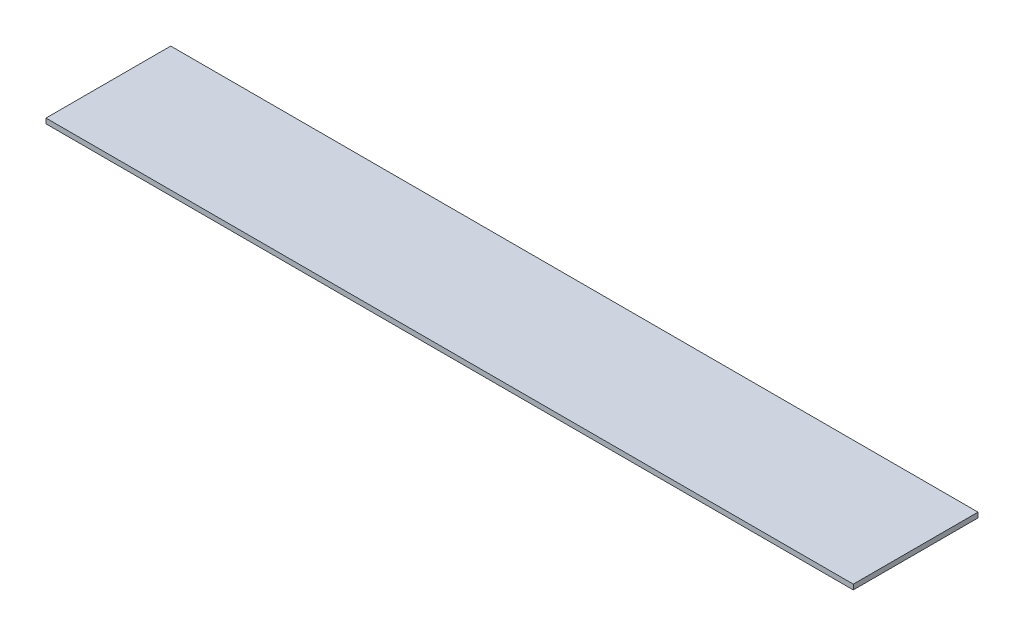
ISO-10303-21;
HEADER;
FILE_DESCRIPTION(('STEP AP214'),'2;1');
FILE_NAME('part.step','',(''),(''),'','','');
FILE_SCHEMA(('AUTOMOTIVE_DESIGN { 1 0 10303 214 1 1 1 1 }'));
ENDSEC;
DATA;
#1=APPLICATION_CONTEXT('core data for automotive mechanical design processes');
#2=APPLICATION_PROTOCOL_DEFINITION('international standard','automotive_design',2000,#1);
#3=PRODUCT_CONTEXT('',#1,'mechanical');
#4=PRODUCT('Part','Part','',(#3));
#5=PRODUCT_RELATED_PRODUCT_CATEGORY('part','',(#4));
#6=PRODUCT_DEFINITION_FORMATION('','',#4);
#7=PRODUCT_DEFINITION_CONTEXT('part definition',#1,'design');
#8=PRODUCT_DEFINITION('design','',#6,#7);
#9=PRODUCT_DEFINITION_SHAPE('','',#8);
#10=(LENGTH_UNIT() NAMED_UNIT(*) SI_UNIT(.MILLI.,.METRE.));
#11=(NAMED_UNIT(*) PLANE_ANGLE_UNIT() SI_UNIT($,.RADIAN.));
#12=(NAMED_UNIT(*) SI_UNIT($,.STERADIAN.) SOLID_ANGLE_UNIT());
#13=UNCERTAINTY_MEASURE_WITH_UNIT(LENGTH_MEASURE(1.E-05),#10,'distance_accuracy_value','');
#14=(GEOMETRIC_REPRESENTATION_CONTEXT(3) GLOBAL_UNCERTAINTY_ASSIGNED_CONTEXT((#13)) GLOBAL_UNIT_ASSIGNED_CONTEXT((#10,
#11,#12)) REPRESENTATION_CONTEXT('',''));
#15=CARTESIAN_POINT('',(0.,0.,0.));
#16=DIRECTION('',(0.,0.,1.));
#17=DIRECTION('',(1.,0.,0.));
#18=AXIS2_PLACEMENT_3D('',#15,#16,#17);
#19=CARTESIAN_POINT('',(0.,6.35,-106.420897149366));
#20=DIRECTION('',(1.,0.,0.));
#21=DIRECTION('',(0.,0.,-1.));
#22=AXIS2_PLACEMENT_3D('',#19,#20,#21);
#23=PLANE('',#22);
#24=DIRECTION('',(0.,0.,1.));
#25=VECTOR('',#24,1.);
#26=CARTESIAN_POINT('',(0.,0.,-106.420897149366));
#27=LINE('',#26,#25);
#28=CARTESIAN_POINT('',(0.,0.,-106.420897149366));
#29=VERTEX_POINT('',#28);
#30=CARTESIAN_POINT('',(0.,0.,50.5332311650279));
#31=VERTEX_POINT('',#30);
#32=EDGE_CURVE('E99',#29,#31,#27,.T.);
#33=ORIENTED_EDGE('',*,*,#32,.T.);
#34=DIRECTION('',(0.,-1.,0.));
#35=VECTOR('',#34,1.);
#36=CARTESIAN_POINT('',(0.,6.35,50.5332311650279));
#37=LINE('',#36,#35);
#38=CARTESIAN_POINT('',(0.,6.35,50.5332311650279));
#39=VERTEX_POINT('',#38);
#40=EDGE_CURVE('E11',#39,#31,#37,.T.);
#41=ORIENTED_EDGE('',*,*,#40,.F.);
#42=DIRECTION('',(0.,0.,1.));
#43=VECTOR('',#42,1.);
#44=CARTESIAN_POINT('',(0.,6.35,-106.420897149366));
#45=LINE('',#44,#43);
#46=CARTESIAN_POINT('',(0.,6.35,-106.420897149366));
#47=VERTEX_POINT('',#46);
#48=EDGE_CURVE('E85',#47,#39,#45,.T.);
#49=ORIENTED_EDGE('',*,*,#48,.F.);
#50=DIRECTION('',(0.,-1.,0.));
#51=VECTOR('',#50,1.);
#52=CARTESIAN_POINT('',(0.,6.35,-106.420897149366));
#53=LINE('',#52,#51);
#54=EDGE_CURVE('E52',#47,#29,#53,.T.);
#55=ORIENTED_EDGE('',*,*,#54,.T.);
#56=EDGE_LOOP('',(#33,#41,#49,#55));
#57=FACE_BOUND('',#56,.T.);
#58=ADVANCED_FACE('F36',(#57),#23,.F.);
#59=CARTESIAN_POINT('',(0.,6.35,50.5332311650279));
#60=DIRECTION('',(0.,0.,-1.));
#61=DIRECTION('',(-1.,0.,0.));
#62=AXIS2_PLACEMENT_3D('',#59,#60,#61);
#63=PLANE('',#62);
#64=DIRECTION('',(1.,0.,0.));
#65=VECTOR('',#64,1.);
#66=CARTESIAN_POINT('',(0.,0.,50.5332311650279));
#67=LINE('',#66,#65);
#68=CARTESIAN_POINT('',(1016.,0.,50.5332311650279));
#69=VERTEX_POINT('',#68);
#70=EDGE_CURVE('E90',#31,#69,#67,.T.);
#71=ORIENTED_EDGE('',*,*,#70,.T.);
#72=DIRECTION('',(0.,-1.,0.));
#73=VECTOR('',#72,1.);
#74=CARTESIAN_POINT('',(1016.,6.35,50.5332311650279));
#75=LINE('',#74,#73);
#76=CARTESIAN_POINT('',(1016.,6.35,50.5332311650279));
#77=VERTEX_POINT('',#76);
#78=EDGE_CURVE('E44',#77,#69,#75,.T.);
#79=ORIENTED_EDGE('',*,*,#78,.F.);
#80=DIRECTION('',(1.,0.,0.));
#81=VECTOR('',#80,1.);
#82=CARTESIAN_POINT('',(0.,6.35,50.5332311650279));
#83=LINE('',#82,#81);
#84=EDGE_CURVE('E77',#39,#77,#83,.T.);
#85=ORIENTED_EDGE('',*,*,#84,.F.);
#86=ORIENTED_EDGE('',*,*,#40,.T.);
#87=EDGE_LOOP('',(#71,#79,#85,#86));
#88=FACE_BOUND('',#87,.T.);
#89=ADVANCED_FACE('F89',(#88),#63,.F.);
#90=CARTESIAN_POINT('',(1016.,6.35,-106.420897149366));
#91=DIRECTION('',(1.,0.,0.));
#92=DIRECTION('',(0.,0.,-1.));
#93=AXIS2_PLACEMENT_3D('',#90,#91,#92);
#94=PLANE('',#93);
#95=DIRECTION('',(0.,0.,1.));
#96=VECTOR('',#95,1.);
#97=CARTESIAN_POINT('',(1016.,0.,-106.420897149366));
#98=LINE('',#97,#96);
#99=CARTESIAN_POINT('',(1016.,0.,-106.420897149366));
#100=VERTEX_POINT('',#99);
#101=EDGE_CURVE('E102',#100,#69,#98,.T.);
#102=ORIENTED_EDGE('',*,*,#101,.F.);
#103=DIRECTION('',(0.,-1.,0.));
#104=VECTOR('',#103,1.);
#105=CARTESIAN_POINT('',(1016.,6.35,-106.420897149366));
#106=LINE('',#105,#104);
#107=CARTESIAN_POINT('',(1016.,6.35,-106.420897149366));
#108=VERTEX_POINT('',#107);
#109=EDGE_CURVE('E66',#108,#100,#106,.T.);
#110=ORIENTED_EDGE('',*,*,#109,.F.);
#111=DIRECTION('',(0.,0.,1.));
#112=VECTOR('',#111,1.);
#113=CARTESIAN_POINT('',(1016.,6.35,-106.420897149366));
#114=LINE('',#113,#112);
#115=EDGE_CURVE('E84',#108,#77,#114,.T.);
#116=ORIENTED_EDGE('',*,*,#115,.T.);
#117=ORIENTED_EDGE('',*,*,#78,.T.);
#118=EDGE_LOOP('',(#102,#110,#116,#117));
#119=FACE_BOUND('',#118,.T.);
#120=ADVANCED_FACE('F93',(#119),#94,.T.);
#121=CARTESIAN_POINT('',(0.,6.35,-106.420897149366));
#122=DIRECTION('',(0.,0.,-1.));
#123=DIRECTION('',(-1.,0.,0.));
#124=AXIS2_PLACEMENT_3D('',#121,#122,#123);
#125=PLANE('',#124);
#126=DIRECTION('',(1.,0.,0.));
#127=VECTOR('',#126,1.);
#128=CARTESIAN_POINT('',(0.,0.,-106.420897149366));
#129=LINE('',#128,#127);
#130=EDGE_CURVE('E104',#29,#100,#129,.T.);
#131=ORIENTED_EDGE('',*,*,#130,.F.);
#132=ORIENTED_EDGE('',*,*,#54,.F.);
#133=DIRECTION('',(1.,0.,0.));
#134=VECTOR('',#133,1.);
#135=CARTESIAN_POINT('',(0.,6.35,-106.420897149366));
#136=LINE('',#135,#134);
#137=EDGE_CURVE('E94',#47,#108,#136,.T.);
#138=ORIENTED_EDGE('',*,*,#137,.T.);
#139=ORIENTED_EDGE('',*,*,#109,.T.);
#140=EDGE_LOOP('',(#131,#132,#138,#139));
#141=FACE_BOUND('',#140,.T.);
#142=ADVANCED_FACE('F110',(#141),#125,.T.);
#143=CARTESIAN_POINT('',(0.,6.35,0.));
#144=DIRECTION('',(0.,1.,0.));
#145=DIRECTION('',(0.,0.,1.));
#146=AXIS2_PLACEMENT_3D('',#143,#144,#145);
#147=PLANE('',#146);
#148=ORIENTED_EDGE('',*,*,#48,.T.);
#149=ORIENTED_EDGE('',*,*,#84,.T.);
#150=ORIENTED_EDGE('',*,*,#115,.F.);
#151=ORIENTED_EDGE('',*,*,#137,.F.);
#152=EDGE_LOOP('',(#148,#149,#150,#151));
#153=FACE_BOUND('',#152,.T.);
#154=ADVANCED_FACE('F81',(#153),#147,.T.);
#155=CARTESIAN_POINT('',(0.,0.,0.));
#156=DIRECTION('',(0.,1.,0.));
#157=DIRECTION('',(0.,0.,1.));
#158=AXIS2_PLACEMENT_3D('',#155,#156,#157);
#159=PLANE('',#158);
#160=ORIENTED_EDGE('',*,*,#32,.F.);
#161=ORIENTED_EDGE('',*,*,#130,.T.);
#162=ORIENTED_EDGE('',*,*,#101,.T.);
#163=ORIENTED_EDGE('',*,*,#70,.F.);
#164=EDGE_LOOP('',(#160,#161,#162,#163));
#165=FACE_BOUND('',#164,.T.);
#166=ADVANCED_FACE('F109',(#165),#159,.F.);
#167=CLOSED_SHELL('',(#58,#89,#120,#142,#154,#166));
#168=MANIFOLD_SOLID_BREP('B2',#167);
#169=ADVANCED_BREP_SHAPE_REPRESENTATION('',(#18,#168),#14);
#170=SHAPE_DEFINITION_REPRESENTATION(#9,#169);
ENDSEC;
END-ISO-10303-21;
